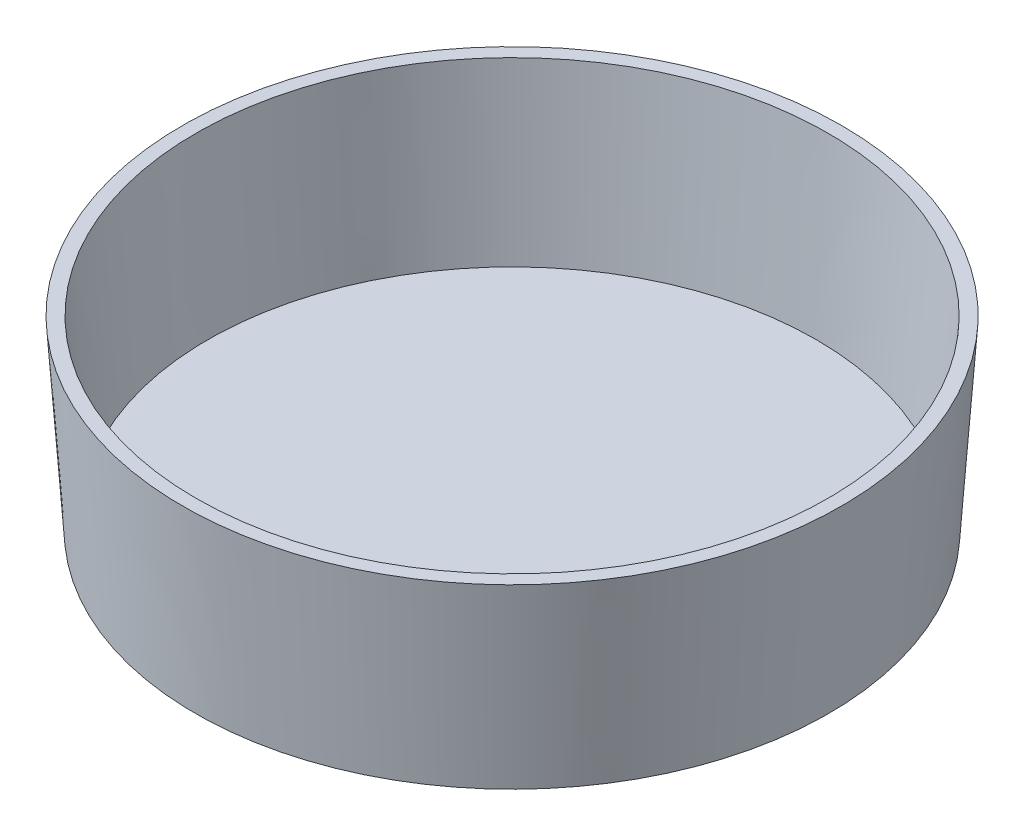
ISO-10303-21;
HEADER;
FILE_DESCRIPTION(('STEP AP214'),'2;1');
FILE_NAME('part.step','',(''),(''),'','','');
FILE_SCHEMA(('AUTOMOTIVE_DESIGN { 1 0 10303 214 1 1 1 1 }'));
ENDSEC;
DATA;
#1=APPLICATION_CONTEXT('core data for automotive mechanical design processes');
#2=APPLICATION_PROTOCOL_DEFINITION('international standard','automotive_design',2000,#1);
#3=PRODUCT_CONTEXT('',#1,'mechanical');
#4=PRODUCT('Part','Part','',(#3));
#5=PRODUCT_RELATED_PRODUCT_CATEGORY('part','',(#4));
#6=PRODUCT_DEFINITION_FORMATION('','',#4);
#7=PRODUCT_DEFINITION_CONTEXT('part definition',#1,'design');
#8=PRODUCT_DEFINITION('design','',#6,#7);
#9=PRODUCT_DEFINITION_SHAPE('','',#8);
#10=(LENGTH_UNIT() NAMED_UNIT(*) SI_UNIT(.MILLI.,.METRE.));
#11=(NAMED_UNIT(*) PLANE_ANGLE_UNIT() SI_UNIT($,.RADIAN.));
#12=(NAMED_UNIT(*) SI_UNIT($,.STERADIAN.) SOLID_ANGLE_UNIT());
#13=UNCERTAINTY_MEASURE_WITH_UNIT(LENGTH_MEASURE(1.E-05),#10,'distance_accuracy_value','');
#14=(GEOMETRIC_REPRESENTATION_CONTEXT(3) GLOBAL_UNCERTAINTY_ASSIGNED_CONTEXT((#13)) GLOBAL_UNIT_ASSIGNED_CONTEXT((#10,
#11,#12)) REPRESENTATION_CONTEXT('',''));
#15=CARTESIAN_POINT('',(0.,0.,0.));
#16=DIRECTION('',(0.,0.,1.));
#17=DIRECTION('',(1.,0.,0.));
#18=AXIS2_PLACEMENT_3D('',#15,#16,#17);
#19=CARTESIAN_POINT('',(0.,14.1224,0.));
#20=DIRECTION('',(0.,1.,0.));
#21=DIRECTION('',(0.,0.,1.));
#22=AXIS2_PLACEMENT_3D('',#19,#20,#21);
#23=PLANE('',#22);
#24=CARTESIAN_POINT('',(0.,14.1224,0.));
#25=DIRECTION('',(0.,1.,0.));
#26=DIRECTION('',(0.,0.,1.));
#27=AXIS2_PLACEMENT_3D('',#24,#25,#26);
#28=CIRCLE('',#27,23.9815671466479);
#29=CARTESIAN_POINT('',(0.,14.1224,23.9815671466479));
#30=VERTEX_POINT('',#29);
#31=EDGE_CURVE('E44',#30,#30,#28,.F.);
#32=ORIENTED_EDGE('',*,*,#31,.T.);
#33=EDGE_LOOP('',(#32));
#34=FACE_BOUND('',#33,.T.);
#35=CARTESIAN_POINT('',(0.,14.1224,0.));
#36=DIRECTION('',(0.,-1.,0.));
#37=DIRECTION('',(0.,0.,-1.));
#38=AXIS2_PLACEMENT_3D('',#35,#36,#37);
#39=CIRCLE('',#38,25.);
#40=CARTESIAN_POINT('',(0.,14.1224,-25.));
#41=VERTEX_POINT('',#40);
#42=EDGE_CURVE('E36',#41,#41,#39,.T.);
#43=ORIENTED_EDGE('',*,*,#42,.F.);
#44=EDGE_LOOP('',(#43));
#45=FACE_BOUND('',#44,.T.);
#46=ADVANCED_FACE('F30',(#34,#45),#23,.T.);
#47=CARTESIAN_POINT('',(0.,0.,0.));
#48=DIRECTION('',(0.,1.,0.));
#49=DIRECTION('',(0.,0.,1.));
#50=AXIS2_PLACEMENT_3D('',#47,#48,#49);
#51=CONICAL_SURFACE('',#50,24.0221,0.0691342499259612);
#52=ORIENTED_EDGE('',*,*,#42,.T.);
#53=EDGE_LOOP('',(#52));
#54=FACE_BOUND('',#53,.T.);
#55=CARTESIAN_POINT('',(0.,0.,0.));
#56=DIRECTION('',(0.,-1.,0.));
#57=DIRECTION('',(0.,0.,-1.));
#58=AXIS2_PLACEMENT_3D('',#55,#56,#57);
#59=CIRCLE('',#58,24.0221);
#60=CARTESIAN_POINT('',(0.,0.,-24.0221));
#61=VERTEX_POINT('',#60);
#62=EDGE_CURVE('E40',#61,#61,#59,.T.);
#63=ORIENTED_EDGE('',*,*,#62,.F.);
#64=EDGE_LOOP('',(#63));
#65=FACE_BOUND('',#64,.T.);
#66=ADVANCED_FACE('F81',(#54,#65),#51,.T.);
#67=CARTESIAN_POINT('',(0.,0.,0.));
#68=DIRECTION('',(0.,-1.,0.));
#69=DIRECTION('',(0.,0.,-1.));
#70=AXIS2_PLACEMENT_3D('',#67,#68,#69);
#71=PLANE('',#70);
#72=CARTESIAN_POINT('',(0.,0.,0.));
#73=DIRECTION('',(0.,-1.,0.));
#74=DIRECTION('',(0.,0.,-1.));
#75=AXIS2_PLACEMENT_3D('',#72,#73,#74);
#76=CIRCLE('',#75,20.9741);
#77=CARTESIAN_POINT('',(0.,0.,20.9741));
#78=VERTEX_POINT('',#77);
#79=EDGE_CURVE('E53',#78,#78,#76,.T.);
#80=ORIENTED_EDGE('',*,*,#79,.F.);
#81=EDGE_LOOP('',(#80));
#82=FACE_BOUND('',#81,.T.);
#83=ORIENTED_EDGE('',*,*,#62,.T.);
#84=EDGE_LOOP('',(#83));
#85=FACE_BOUND('',#84,.T.);
#86=ADVANCED_FACE('F86',(#82,#85),#71,.T.);
#87=CARTESIAN_POINT('',(0.,0.0701844584432989,0.));
#88=DIRECTION('',(0.,1.,0.));
#89=DIRECTION('',(0.,0.,1.));
#90=AXIS2_PLACEMENT_3D('',#87,#88,#89);
#91=CONICAL_SURFACE('',#90,23.008527041702,0.0691342499259612);
#92=ORIENTED_EDGE('',*,*,#31,.F.);
#93=EDGE_LOOP('',(#92));
#94=FACE_BOUND('',#93,.T.);
#95=CARTESIAN_POINT('',(0.,1.016,0.));
#96=DIRECTION('',(0.,-1.,0.));
#97=DIRECTION('',(0.,0.,-1.));
#98=AXIS2_PLACEMENT_3D('',#95,#96,#97);
#99=CIRCLE('',#98,23.0740196646335);
#100=CARTESIAN_POINT('',(0.,1.016,-23.0740196646335));
#101=VERTEX_POINT('',#100);
#102=EDGE_CURVE('E49',#101,#101,#99,.T.);
#103=ORIENTED_EDGE('',*,*,#102,.T.);
#104=EDGE_LOOP('',(#103));
#105=FACE_BOUND('',#104,.T.);
#106=ADVANCED_FACE('F76',(#94,#105),#91,.F.);
#107=CARTESIAN_POINT('',(0.,1.016,0.));
#108=DIRECTION('',(0.,-1.,0.));
#109=DIRECTION('',(0.,0.,-1.));
#110=AXIS2_PLACEMENT_3D('',#107,#108,#109);
#111=PLANE('',#110);
#112=ORIENTED_EDGE('',*,*,#102,.F.);
#113=EDGE_LOOP('',(#112));
#114=FACE_BOUND('',#113,.T.);
#115=ADVANCED_FACE('F67',(#114),#111,.F.);
#116=CARTESIAN_POINT('',(0.,-0.762,0.));
#117=DIRECTION('',(0.,-1.,0.));
#118=DIRECTION('',(0.,0.,-1.));
#119=AXIS2_PLACEMENT_3D('',#116,#117,#118);
#120=PLANE('',#119);
#121=CARTESIAN_POINT('',(0.,-0.762,0.));
#122=DIRECTION('',(0.,-1.,0.));
#123=DIRECTION('',(0.,0.,-1.));
#124=AXIS2_PLACEMENT_3D('',#121,#122,#123);
#125=CIRCLE('',#124,20.9741);
#126=CARTESIAN_POINT('',(0.,-0.762,20.9741));
#127=VERTEX_POINT('',#126);
#128=EDGE_CURVE('E52',#127,#127,#125,.T.);
#129=ORIENTED_EDGE('',*,*,#128,.T.);
#130=EDGE_LOOP('',(#129));
#131=FACE_BOUND('',#130,.T.);
#132=CARTESIAN_POINT('',(0.,-0.762,0.));
#133=DIRECTION('',(0.,-1.,0.));
#134=DIRECTION('',(0.,0.,-1.));
#135=AXIS2_PLACEMENT_3D('',#132,#133,#134);
#136=CIRCLE('',#135,20.2883);
#137=CARTESIAN_POINT('',(0.,-0.762,20.2883));
#138=VERTEX_POINT('',#137);
#139=EDGE_CURVE('E56',#138,#138,#136,.T.);
#140=ORIENTED_EDGE('',*,*,#139,.F.);
#141=EDGE_LOOP('',(#140));
#142=FACE_BOUND('',#141,.T.);
#143=ADVANCED_FACE('F64',(#131,#142),#120,.T.);
#144=CARTESIAN_POINT('',(0.,-0.762,0.));
#145=DIRECTION('',(0.,1.,0.));
#146=DIRECTION('',(0.,0.,1.));
#147=AXIS2_PLACEMENT_3D('',#144,#145,#146);
#148=CYLINDRICAL_SURFACE('',#147,20.9741);
#149=CARTESIAN_POINT('',(0.,-0.762,20.9741));
#150=CARTESIAN_POINT('',(0.,-0.7540625,20.9741));
#151=CARTESIAN_POINT('',(0.,-0.746125,20.9741));
#152=CARTESIAN_POINT('',(0.,-0.73025,20.9741));
#153=CARTESIAN_POINT('',(0.,-0.7223125,20.9741));
#154=CARTESIAN_POINT('',(0.,-0.7064375,20.9741));
#155=CARTESIAN_POINT('',(0.,-0.6985,20.9741));
#156=CARTESIAN_POINT('',(0.,-0.682625,20.9741));
#157=CARTESIAN_POINT('',(0.,-0.6746875,20.9741));
#158=CARTESIAN_POINT('',(0.,-0.6588125,20.9741));
#159=CARTESIAN_POINT('',(0.,-0.650875,20.9741));
#160=CARTESIAN_POINT('',(0.,-0.635,20.9741));
#161=CARTESIAN_POINT('',(0.,-0.6270625,20.9741));
#162=CARTESIAN_POINT('',(0.,-0.6111875,20.9741));
#163=CARTESIAN_POINT('',(0.,-0.60325,20.9741));
#164=CARTESIAN_POINT('',(0.,-0.587375,20.9741));
#165=CARTESIAN_POINT('',(0.,-0.5794375,20.9741));
#166=CARTESIAN_POINT('',(0.,-0.5635625,20.9741));
#167=CARTESIAN_POINT('',(0.,-0.555625,20.9741));
#168=CARTESIAN_POINT('',(0.,-0.53975,20.9741));
#169=CARTESIAN_POINT('',(0.,-0.5318125,20.9741));
#170=CARTESIAN_POINT('',(0.,-0.5159375,20.9741));
#171=CARTESIAN_POINT('',(0.,-0.508,20.9741));
#172=CARTESIAN_POINT('',(0.,-0.492125,20.9741));
#173=CARTESIAN_POINT('',(0.,-0.4841875,20.9741));
#174=CARTESIAN_POINT('',(0.,-0.4683125,20.9741));
#175=CARTESIAN_POINT('',(0.,-0.460375,20.9741));
#176=CARTESIAN_POINT('',(0.,-0.4445,20.9741));
#177=CARTESIAN_POINT('',(0.,-0.4365625,20.9741));
#178=CARTESIAN_POINT('',(0.,-0.4206875,20.9741));
#179=CARTESIAN_POINT('',(0.,-0.41275,20.9741));
#180=CARTESIAN_POINT('',(0.,-0.396875,20.9741));
#181=CARTESIAN_POINT('',(0.,-0.3889375,20.9741));
#182=CARTESIAN_POINT('',(0.,-0.3730625,20.9741));
#183=CARTESIAN_POINT('',(0.,-0.365125,20.9741));
#184=CARTESIAN_POINT('',(0.,-0.34925,20.9741));
#185=CARTESIAN_POINT('',(0.,-0.3413125,20.9741));
#186=CARTESIAN_POINT('',(0.,-0.3254375,20.9741));
#187=CARTESIAN_POINT('',(0.,-0.3175,20.9741));
#188=CARTESIAN_POINT('',(0.,-0.301625,20.9741));
#189=CARTESIAN_POINT('',(0.,-0.2936875,20.9741));
#190=CARTESIAN_POINT('',(0.,-0.2778125,20.9741));
#191=CARTESIAN_POINT('',(0.,-0.269875,20.9741));
#192=CARTESIAN_POINT('',(0.,-0.254,20.9741));
#193=CARTESIAN_POINT('',(0.,-0.2460625,20.9741));
#194=CARTESIAN_POINT('',(0.,-0.2301875,20.9741));
#195=CARTESIAN_POINT('',(0.,-0.22225,20.9741));
#196=CARTESIAN_POINT('',(0.,-0.206375,20.9741));
#197=CARTESIAN_POINT('',(0.,-0.1984375,20.9741));
#198=CARTESIAN_POINT('',(0.,-0.1825625,20.9741));
#199=CARTESIAN_POINT('',(0.,-0.174625,20.9741));
#200=CARTESIAN_POINT('',(0.,-0.15875,20.9741));
#201=CARTESIAN_POINT('',(0.,-0.1508125,20.9741));
#202=CARTESIAN_POINT('',(0.,-0.1349375,20.9741));
#203=CARTESIAN_POINT('',(0.,-0.127,20.9741));
#204=CARTESIAN_POINT('',(0.,-0.111125,20.9741));
#205=CARTESIAN_POINT('',(0.,-0.1031875,20.9741));
#206=CARTESIAN_POINT('',(0.,-0.0873125,20.9741));
#207=CARTESIAN_POINT('',(0.,-0.079375,20.9741));
#208=CARTESIAN_POINT('',(0.,-0.0635,20.9741));
#209=CARTESIAN_POINT('',(0.,-0.0555625,20.9741));
#210=CARTESIAN_POINT('',(0.,-0.0396875,20.9741));
#211=CARTESIAN_POINT('',(0.,-0.03175,20.9741));
#212=CARTESIAN_POINT('',(0.,-0.015875,20.9741));
#213=CARTESIAN_POINT('',(0.,-0.00793749999999999,20.9741));
#214=CARTESIAN_POINT('',(0.,0.,20.9741));
#215=B_SPLINE_CURVE_WITH_KNOTS('',3,(#149,#150,#151,#152,#153,#154,#155,#156,#157,#158,#159,
#160,#161,#162,#163,#164,#165,#166,#167,#168,#169,#170,#171,#172,#173,#174,#175,#176,#177,#178,
#179,#180,#181,#182,#183,#184,#185,#186,#187,#188,#189,#190,#191,#192,#193,#194,#195,#196,#197,
#198,#199,#200,#201,#202,#203,#204,#205,#206,#207,#208,#209,#210,#211,#212,#213,#214),
.UNSPECIFIED.,.F.,.F.,(4,2,2,2,2,2,2,2,2,2,2,2,2,2,2,2,2,2,2,2,2,2,2,2,2,2,2,2,2,2,2,2,4),(0.,
0.0238125,0.0476249999999999,0.0714374999999999,0.09525,0.1190625,0.142875,0.1666875,0.1905,
0.2143125,0.238125,0.2619375,0.28575,0.3095625,0.333375,0.3571875,0.381,0.4048125,0.428625,
0.4524375,0.47625,0.5000625,0.523875,0.5476875,0.5715,0.5953125,0.619125,0.6429375,0.66675,
0.6905625,0.714375,0.7381875,0.762),.UNSPECIFIED.);
#216=EDGE_CURVE('BSEAM66',#127,#78,#215,.T.);
#217=ORIENTED_EDGE('',*,*,#128,.F.);
#218=ORIENTED_EDGE('',*,*,#79,.T.);
#219=ORIENTED_EDGE('',*,*,#216,.T.);
#220=ORIENTED_EDGE('',*,*,#216,.F.);
#221=EDGE_LOOP('',(#217,#219,#218,#220));
#222=FACE_BOUND('',#221,.T.);
#223=ADVANCED_FACE('F66',(#222),#148,.T.);
#224=CARTESIAN_POINT('',(0.,-0.762,0.));
#225=DIRECTION('',(0.,1.,0.));
#226=DIRECTION('',(0.,0.,1.));
#227=AXIS2_PLACEMENT_3D('',#224,#225,#226);
#228=CYLINDRICAL_SURFACE('',#227,20.2883);
#229=CARTESIAN_POINT('',(0.,0.,0.));
#230=DIRECTION('',(0.,-1.,0.));
#231=DIRECTION('',(0.,0.,-1.));
#232=AXIS2_PLACEMENT_3D('',#229,#230,#231);
#233=CIRCLE('',#232,20.2883);
#234=CARTESIAN_POINT('',(0.,0.,20.2883));
#235=VERTEX_POINT('',#234);
#236=EDGE_CURVE('E10',#235,#235,#233,.F.);
#237=CARTESIAN_POINT('',(0.,-0.762,20.2883));
#238=CARTESIAN_POINT('',(0.,-0.7540625,20.2883));
#239=CARTESIAN_POINT('',(0.,-0.746125,20.2883));
#240=CARTESIAN_POINT('',(0.,-0.73025,20.2883));
#241=CARTESIAN_POINT('',(0.,-0.7223125,20.2883));
#242=CARTESIAN_POINT('',(0.,-0.7064375,20.2883));
#243=CARTESIAN_POINT('',(0.,-0.6985,20.2883));
#244=CARTESIAN_POINT('',(0.,-0.682625,20.2883));
#245=CARTESIAN_POINT('',(0.,-0.6746875,20.2883));
#246=CARTESIAN_POINT('',(0.,-0.6588125,20.2883));
#247=CARTESIAN_POINT('',(0.,-0.650875,20.2883));
#248=CARTESIAN_POINT('',(0.,-0.635,20.2883));
#249=CARTESIAN_POINT('',(0.,-0.6270625,20.2883));
#250=CARTESIAN_POINT('',(0.,-0.6111875,20.2883));
#251=CARTESIAN_POINT('',(0.,-0.60325,20.2883));
#252=CARTESIAN_POINT('',(0.,-0.587375,20.2883));
#253=CARTESIAN_POINT('',(0.,-0.5794375,20.2883));
#254=CARTESIAN_POINT('',(0.,-0.5635625,20.2883));
#255=CARTESIAN_POINT('',(0.,-0.555625,20.2883));
#256=CARTESIAN_POINT('',(0.,-0.53975,20.2883));
#257=CARTESIAN_POINT('',(0.,-0.5318125,20.2883));
#258=CARTESIAN_POINT('',(0.,-0.5159375,20.2883));
#259=CARTESIAN_POINT('',(0.,-0.508,20.2883));
#260=CARTESIAN_POINT('',(0.,-0.492125,20.2883));
#261=CARTESIAN_POINT('',(0.,-0.4841875,20.2883));
#262=CARTESIAN_POINT('',(0.,-0.4683125,20.2883));
#263=CARTESIAN_POINT('',(0.,-0.460375,20.2883));
#264=CARTESIAN_POINT('',(0.,-0.4445,20.2883));
#265=CARTESIAN_POINT('',(0.,-0.4365625,20.2883));
#266=CARTESIAN_POINT('',(0.,-0.4206875,20.2883));
#267=CARTESIAN_POINT('',(0.,-0.41275,20.2883));
#268=CARTESIAN_POINT('',(0.,-0.396875,20.2883));
#269=CARTESIAN_POINT('',(0.,-0.3889375,20.2883));
#270=CARTESIAN_POINT('',(0.,-0.3730625,20.2883));
#271=CARTESIAN_POINT('',(0.,-0.365125,20.2883));
#272=CARTESIAN_POINT('',(0.,-0.34925,20.2883));
#273=CARTESIAN_POINT('',(0.,-0.3413125,20.2883));
#274=CARTESIAN_POINT('',(0.,-0.3254375,20.2883));
#275=CARTESIAN_POINT('',(0.,-0.3175,20.2883));
#276=CARTESIAN_POINT('',(0.,-0.301625,20.2883));
#277=CARTESIAN_POINT('',(0.,-0.2936875,20.2883));
#278=CARTESIAN_POINT('',(0.,-0.2778125,20.2883));
#279=CARTESIAN_POINT('',(0.,-0.269875,20.2883));
#280=CARTESIAN_POINT('',(0.,-0.254,20.2883));
#281=CARTESIAN_POINT('',(0.,-0.2460625,20.2883));
#282=CARTESIAN_POINT('',(0.,-0.2301875,20.2883));
#283=CARTESIAN_POINT('',(0.,-0.22225,20.2883));
#284=CARTESIAN_POINT('',(0.,-0.206375,20.2883));
#285=CARTESIAN_POINT('',(0.,-0.1984375,20.2883));
#286=CARTESIAN_POINT('',(0.,-0.1825625,20.2883));
#287=CARTESIAN_POINT('',(0.,-0.174625,20.2883));
#288=CARTESIAN_POINT('',(0.,-0.15875,20.2883));
#289=CARTESIAN_POINT('',(0.,-0.1508125,20.2883));
#290=CARTESIAN_POINT('',(0.,-0.1349375,20.2883));
#291=CARTESIAN_POINT('',(0.,-0.127,20.2883));
#292=CARTESIAN_POINT('',(0.,-0.111125,20.2883));
#293=CARTESIAN_POINT('',(0.,-0.1031875,20.2883));
#294=CARTESIAN_POINT('',(0.,-0.0873125,20.2883));
#295=CARTESIAN_POINT('',(0.,-0.079375,20.2883));
#296=CARTESIAN_POINT('',(0.,-0.0635,20.2883));
#297=CARTESIAN_POINT('',(0.,-0.0555625,20.2883));
#298=CARTESIAN_POINT('',(0.,-0.0396875,20.2883));
#299=CARTESIAN_POINT('',(0.,-0.03175,20.2883));
#300=CARTESIAN_POINT('',(0.,-0.015875,20.2883));
#301=CARTESIAN_POINT('',(0.,-0.00793749999999999,20.2883));
#302=CARTESIAN_POINT('',(0.,0.,20.2883));
#303=B_SPLINE_CURVE_WITH_KNOTS('',3,(#237,#238,#239,#240,#241,#242,#243,#244,#245,#246,#247,
#248,#249,#250,#251,#252,#253,#254,#255,#256,#257,#258,#259,#260,#261,#262,#263,#264,#265,#266,
#267,#268,#269,#270,#271,#272,#273,#274,#275,#276,#277,#278,#279,#280,#281,#282,#283,#284,#285,
#286,#287,#288,#289,#290,#291,#292,#293,#294,#295,#296,#297,#298,#299,#300,#301,#302),
.UNSPECIFIED.,.F.,.F.,(4,2,2,2,2,2,2,2,2,2,2,2,2,2,2,2,2,2,2,2,2,2,2,2,2,2,2,2,2,2,2,2,4),(0.,
0.0238125,0.0476249999999999,0.0714374999999999,0.09525,0.1190625,0.142875,0.1666875,0.1905,
0.2143125,0.238125,0.2619375,0.28575,0.3095625,0.333375,0.3571875,0.381,0.4048125,0.428625,
0.4524375,0.47625,0.5000625,0.523875,0.5476875,0.5715,0.5953125,0.619125,0.6429375,0.66675,
0.6905625,0.714375,0.7381875,0.762),.UNSPECIFIED.);
#304=EDGE_CURVE('BSEAM62',#138,#235,#303,.T.);
#305=ORIENTED_EDGE('',*,*,#139,.T.);
#306=ORIENTED_EDGE('',*,*,#236,.T.);
#307=ORIENTED_EDGE('',*,*,#304,.T.);
#308=ORIENTED_EDGE('',*,*,#304,.F.);
#309=EDGE_LOOP('',(#305,#307,#306,#308));
#310=FACE_BOUND('',#309,.T.);
#311=ADVANCED_FACE('F62',(#310),#228,.F.);
#312=ORIENTED_EDGE('',*,*,#236,.F.);
#313=EDGE_LOOP('',(#312));
#314=FACE_BOUND('',#313,.T.);
#315=ADVANCED_FACE('F99',(#314),#71,.T.);
#316=CLOSED_SHELL('',(#46,#66,#86,#106,#115,#143,#223,#311,#315));
#317=MANIFOLD_SOLID_BREP('B2',#316);
#318=ADVANCED_BREP_SHAPE_REPRESENTATION('',(#18,#317),#14);
#319=SHAPE_DEFINITION_REPRESENTATION(#9,#318);
ENDSEC;
END-ISO-10303-21;
